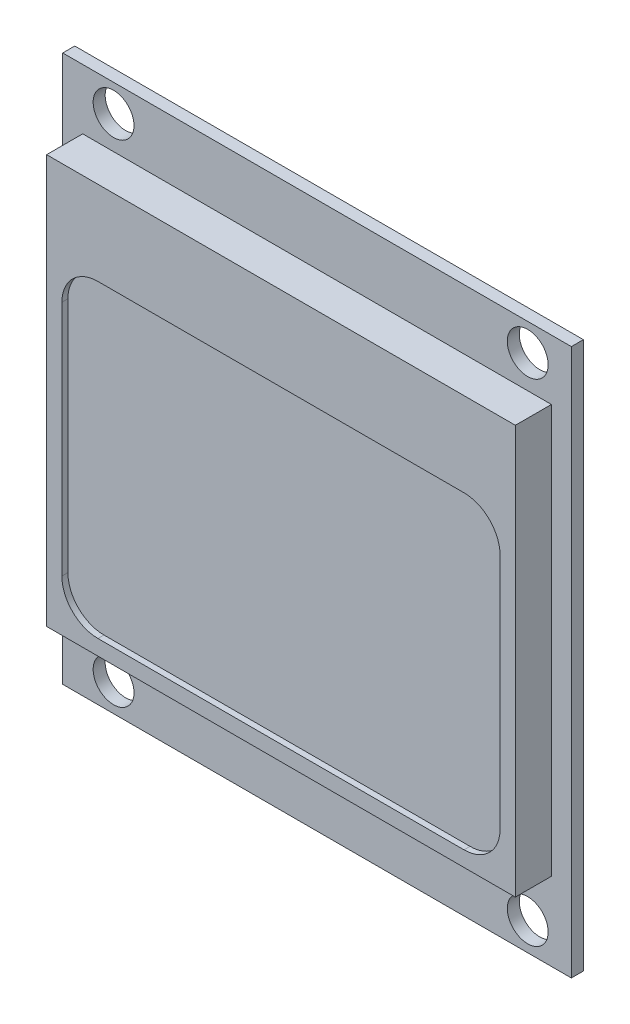
ISO-10303-21;
HEADER;
FILE_DESCRIPTION(('STEP AP214'),'2;1');
FILE_NAME('part.step','',(''),(''),'','','');
FILE_SCHEMA(('AUTOMOTIVE_DESIGN { 1 0 10303 214 1 1 1 1 }'));
ENDSEC;
DATA;
#1=APPLICATION_CONTEXT('core data for automotive mechanical design processes');
#2=APPLICATION_PROTOCOL_DEFINITION('international standard','automotive_design',2000,#1);
#3=PRODUCT_CONTEXT('',#1,'mechanical');
#4=PRODUCT('Part','Part','',(#3));
#5=PRODUCT_RELATED_PRODUCT_CATEGORY('part','',(#4));
#6=PRODUCT_DEFINITION_FORMATION('','',#4);
#7=PRODUCT_DEFINITION_CONTEXT('part definition',#1,'design');
#8=PRODUCT_DEFINITION('design','',#6,#7);
#9=PRODUCT_DEFINITION_SHAPE('','',#8);
#10=(LENGTH_UNIT() NAMED_UNIT(*) SI_UNIT(.MILLI.,.METRE.));
#11=(NAMED_UNIT(*) PLANE_ANGLE_UNIT() SI_UNIT($,.RADIAN.));
#12=(NAMED_UNIT(*) SI_UNIT($,.STERADIAN.) SOLID_ANGLE_UNIT());
#13=UNCERTAINTY_MEASURE_WITH_UNIT(LENGTH_MEASURE(1.E-05),#10,'distance_accuracy_value','');
#14=(GEOMETRIC_REPRESENTATION_CONTEXT(3) GLOBAL_UNCERTAINTY_ASSIGNED_CONTEXT((#13)) GLOBAL_UNIT_ASSIGNED_CONTEXT((#10,
#11,#12)) REPRESENTATION_CONTEXT('',''));
#15=CARTESIAN_POINT('',(0.,0.,0.));
#16=DIRECTION('',(0.,0.,1.));
#17=DIRECTION('',(1.,0.,0.));
#18=AXIS2_PLACEMENT_3D('',#15,#16,#17);
#19=CARTESIAN_POINT('',(0.,0.,12.));
#20=DIRECTION('',(0.,0.,-1.));
#21=DIRECTION('',(-1.,0.,0.));
#22=AXIS2_PLACEMENT_3D('',#19,#20,#21);
#23=PLANE('',#22);
#24=CARTESIAN_POINT('',(51.946913893828,63.235712471425,12.));
#25=DIRECTION('',(0.,0.,1.));
#26=DIRECTION('',(1.,0.,0.));
#27=AXIS2_PLACEMENT_3D('',#24,#25,#26);
#28=CIRCLE('',#27,1.7);
#29=CARTESIAN_POINT('',(53.646913893828,63.235712471425,12.));
#30=VERTEX_POINT('',#29);
#31=EDGE_CURVE('E273',#30,#30,#28,.T.);
#32=ORIENTED_EDGE('',*,*,#31,.F.);
#33=EDGE_LOOP('',(#32));
#34=FACE_BOUND('',#33,.T.);
#35=CARTESIAN_POINT('',(17.486918973838,63.235712471425,12.));
#36=DIRECTION('',(0.,0.,1.));
#37=DIRECTION('',(1.,0.,0.));
#38=AXIS2_PLACEMENT_3D('',#35,#36,#37);
#39=CIRCLE('',#38,1.7);
#40=CARTESIAN_POINT('',(19.186918973838,63.235712471425,12.));
#41=VERTEX_POINT('',#40);
#42=EDGE_CURVE('E279',#41,#41,#39,.T.);
#43=ORIENTED_EDGE('',*,*,#42,.F.);
#44=EDGE_LOOP('',(#43));
#45=FACE_BOUND('',#44,.T.);
#46=CARTESIAN_POINT('',(17.486918973838,22.360680721361,12.));
#47=DIRECTION('',(0.,0.,1.));
#48=DIRECTION('',(1.,0.,0.));
#49=AXIS2_PLACEMENT_3D('',#46,#47,#48);
#50=CIRCLE('',#49,1.7);
#51=CARTESIAN_POINT('',(19.186918973838,22.360680721361,12.));
#52=VERTEX_POINT('',#51);
#53=EDGE_CURVE('E285',#52,#52,#50,.T.);
#54=ORIENTED_EDGE('',*,*,#53,.F.);
#55=EDGE_LOOP('',(#54));
#56=FACE_BOUND('',#55,.T.);
#57=CARTESIAN_POINT('',(51.946913893828,22.360680721361,12.));
#58=DIRECTION('',(0.,0.,1.));
#59=DIRECTION('',(1.,0.,0.));
#60=AXIS2_PLACEMENT_3D('',#57,#58,#59);
#61=CIRCLE('',#60,1.7);
#62=CARTESIAN_POINT('',(53.646913893828,22.360680721361,12.));
#63=VERTEX_POINT('',#62);
#64=EDGE_CURVE('E291',#63,#63,#61,.T.);
#65=ORIENTED_EDGE('',*,*,#64,.F.);
#66=EDGE_LOOP('',(#65));
#67=FACE_BOUND('',#66,.T.);
#68=DIRECTION('',(0.,-1.,0.));
#69=VECTOR('',#68,1.);
#70=CARTESIAN_POINT('',(13.25698501397,20.0127000254,12.));
#71=LINE('',#70,#69);
#72=CARTESIAN_POINT('',(13.25698501397,65.5127000254,12.));
#73=VERTEX_POINT('',#72);
#74=CARTESIAN_POINT('',(13.25698501397,20.0127000254,12.));
#75=VERTEX_POINT('',#74);
#76=EDGE_CURVE('E297',#73,#75,#71,.T.);
#77=ORIENTED_EDGE('',*,*,#76,.T.);
#78=DIRECTION('',(1.,0.,0.));
#79=VECTOR('',#78,1.);
#80=CARTESIAN_POINT('',(13.25698501397,20.0127000254,12.));
#81=LINE('',#80,#79);
#82=CARTESIAN_POINT('',(55.57698501397,20.0127000254,12.));
#83=VERTEX_POINT('',#82);
#84=EDGE_CURVE('E300',#75,#83,#81,.T.);
#85=ORIENTED_EDGE('',*,*,#84,.T.);
#86=DIRECTION('',(0.,1.,0.));
#87=VECTOR('',#86,1.);
#88=CARTESIAN_POINT('',(55.57698501397,20.0127000254,12.));
#89=LINE('',#88,#87);
#90=CARTESIAN_POINT('',(55.57698501397,65.5127000254,12.));
#91=VERTEX_POINT('',#90);
#92=EDGE_CURVE('E303',#83,#91,#89,.T.);
#93=ORIENTED_EDGE('',*,*,#92,.T.);
#94=DIRECTION('',(-1.,0.,0.));
#95=VECTOR('',#94,1.);
#96=CARTESIAN_POINT('',(13.25698501397,65.5127000254,12.));
#97=LINE('',#96,#95);
#98=EDGE_CURVE('E305',#91,#73,#97,.T.);
#99=ORIENTED_EDGE('',*,*,#98,.T.);
#100=EDGE_LOOP('',(#77,#85,#93,#99));
#101=FACE_BOUND('',#100,.T.);
#102=DIRECTION('',(0.,-1.,0.));
#103=VECTOR('',#102,1.);
#104=CARTESIAN_POINT('',(14.91698501397,60.5127000254,12.));
#105=LINE('',#104,#103);
#106=CARTESIAN_POINT('',(14.91698501397,60.5127000254,12.));
#107=VERTEX_POINT('',#106);
#108=CARTESIAN_POINT('',(14.91698501397,26.5127000254,12.));
#109=VERTEX_POINT('',#108);
#110=EDGE_CURVE('E58',#107,#109,#105,.T.);
#111=ORIENTED_EDGE('',*,*,#110,.F.);
#112=DIRECTION('',(-1.,0.,0.));
#113=VECTOR('',#112,1.);
#114=CARTESIAN_POINT('',(14.91698501397,60.5127000254,12.));
#115=LINE('',#114,#113);
#116=CARTESIAN_POINT('',(53.91698501397,60.5127000254,12.));
#117=VERTEX_POINT('',#116);
#118=EDGE_CURVE('E246',#117,#107,#115,.T.);
#119=ORIENTED_EDGE('',*,*,#118,.F.);
#120=DIRECTION('',(0.,1.,0.));
#121=VECTOR('',#120,1.);
#122=CARTESIAN_POINT('',(53.91698501397,60.5127000254,12.));
#123=LINE('',#122,#121);
#124=CARTESIAN_POINT('',(53.91698501397,26.5127000254,12.));
#125=VERTEX_POINT('',#124);
#126=EDGE_CURVE('E257',#125,#117,#123,.T.);
#127=ORIENTED_EDGE('',*,*,#126,.F.);
#128=DIRECTION('',(1.,0.,0.));
#129=VECTOR('',#128,1.);
#130=CARTESIAN_POINT('',(14.91698501397,26.5127000254,12.));
#131=LINE('',#130,#129);
#132=EDGE_CURVE('E254',#109,#125,#131,.T.);
#133=ORIENTED_EDGE('',*,*,#132,.F.);
#134=EDGE_LOOP('',(#111,#119,#127,#133));
#135=FACE_BOUND('',#134,.T.);
#136=ADVANCED_FACE('F35',(#34,#45,#56,#67,#101,#135),#23,.F.);
#137=CARTESIAN_POINT('',(24.25698501397,22.095786131572,11.));
#138=DIRECTION('',(1.,0.,0.));
#139=DIRECTION('',(0.,0.,-1.));
#140=AXIS2_PLACEMENT_3D('',#137,#138,#139);
#141=PLANE('',#140);
#142=DIRECTION('',(0.,-1.,0.));
#143=VECTOR('',#142,1.);
#144=CARTESIAN_POINT('',(24.25698501397,22.095786131572,0.));
#145=LINE('',#144,#143);
#146=CARTESIAN_POINT('',(24.25698501397,24.635786131572,0.));
#147=VERTEX_POINT('',#146);
#148=CARTESIAN_POINT('',(24.25698501397,22.095786131572,0.));
#149=VERTEX_POINT('',#148);
#150=EDGE_CURVE('E326',#147,#149,#145,.T.);
#151=ORIENTED_EDGE('',*,*,#150,.T.);
#152=DIRECTION('',(0.,0.,-1.));
#153=VECTOR('',#152,1.);
#154=CARTESIAN_POINT('',(24.25698501397,22.095786131572,11.));
#155=LINE('',#154,#153);
#156=CARTESIAN_POINT('',(24.25698501397,22.095786131572,11.));
#157=VERTEX_POINT('',#156);
#158=EDGE_CURVE('E11',#157,#149,#155,.T.);
#159=ORIENTED_EDGE('',*,*,#158,.F.);
#160=DIRECTION('',(0.,-1.,0.));
#161=VECTOR('',#160,1.);
#162=CARTESIAN_POINT('',(24.25698501397,22.095786131572,11.));
#163=LINE('',#162,#161);
#164=CARTESIAN_POINT('',(24.25698501397,24.635786131572,11.));
#165=VERTEX_POINT('',#164);
#166=EDGE_CURVE('E327',#165,#157,#163,.T.);
#167=ORIENTED_EDGE('',*,*,#166,.F.);
#168=DIRECTION('',(0.,0.,-1.));
#169=VECTOR('',#168,1.);
#170=CARTESIAN_POINT('',(24.25698501397,24.635786131572,11.));
#171=LINE('',#170,#169);
#172=EDGE_CURVE('E340',#165,#147,#171,.T.);
#173=ORIENTED_EDGE('',*,*,#172,.T.);
#174=EDGE_LOOP('',(#151,#159,#167,#173));
#175=FACE_BOUND('',#174,.T.);
#176=ADVANCED_FACE('F37',(#175),#141,.F.);
#177=CARTESIAN_POINT('',(24.25698501397,22.095786131572,11.));
#178=DIRECTION('',(0.,1.,0.));
#179=DIRECTION('',(0.,0.,1.));
#180=AXIS2_PLACEMENT_3D('',#177,#178,#179);
#181=PLANE('',#180);
#182=DIRECTION('',(1.,0.,0.));
#183=VECTOR('',#182,1.);
#184=CARTESIAN_POINT('',(24.25698501397,22.095786131572,0.));
#185=LINE('',#184,#183);
#186=CARTESIAN_POINT('',(44.57698501397,22.095786131572,0.));
#187=VERTEX_POINT('',#186);
#188=EDGE_CURVE('E343',#149,#187,#185,.T.);
#189=ORIENTED_EDGE('',*,*,#188,.T.);
#190=DIRECTION('',(0.,0.,-1.));
#191=VECTOR('',#190,1.);
#192=CARTESIAN_POINT('',(44.57698501397,22.095786131572,11.));
#193=LINE('',#192,#191);
#194=CARTESIAN_POINT('',(44.57698501397,22.095786131572,11.));
#195=VERTEX_POINT('',#194);
#196=EDGE_CURVE('E43',#195,#187,#193,.T.);
#197=ORIENTED_EDGE('',*,*,#196,.F.);
#198=DIRECTION('',(1.,0.,0.));
#199=VECTOR('',#198,1.);
#200=CARTESIAN_POINT('',(24.25698501397,22.095786131572,11.));
#201=LINE('',#200,#199);
#202=EDGE_CURVE('E330',#157,#195,#201,.T.);
#203=ORIENTED_EDGE('',*,*,#202,.F.);
#204=ORIENTED_EDGE('',*,*,#158,.T.);
#205=EDGE_LOOP('',(#189,#197,#203,#204));
#206=FACE_BOUND('',#205,.T.);
#207=ADVANCED_FACE('F371',(#206),#181,.F.);
#208=CARTESIAN_POINT('',(44.57698501397,22.095786131572,11.));
#209=DIRECTION('',(-1.,0.,0.));
#210=DIRECTION('',(0.,-1.,0.));
#211=AXIS2_PLACEMENT_3D('',#208,#209,#210);
#212=PLANE('',#211);
#213=DIRECTION('',(0.,1.,0.));
#214=VECTOR('',#213,1.);
#215=CARTESIAN_POINT('',(44.57698501397,22.095786131572,0.));
#216=LINE('',#215,#214);
#217=CARTESIAN_POINT('',(44.57698501397,24.635786131572,0.));
#218=VERTEX_POINT('',#217);
#219=EDGE_CURVE('E345',#187,#218,#216,.T.);
#220=ORIENTED_EDGE('',*,*,#219,.T.);
#221=DIRECTION('',(0.,0.,-1.));
#222=VECTOR('',#221,1.);
#223=CARTESIAN_POINT('',(44.57698501397,24.635786131572,11.));
#224=LINE('',#223,#222);
#225=CARTESIAN_POINT('',(44.57698501397,24.635786131572,11.));
#226=VERTEX_POINT('',#225);
#227=EDGE_CURVE('E350',#226,#218,#224,.T.);
#228=ORIENTED_EDGE('',*,*,#227,.F.);
#229=DIRECTION('',(0.,1.,0.));
#230=VECTOR('',#229,1.);
#231=CARTESIAN_POINT('',(44.57698501397,22.095786131572,11.));
#232=LINE('',#231,#230);
#233=EDGE_CURVE('E334',#195,#226,#232,.T.);
#234=ORIENTED_EDGE('',*,*,#233,.F.);
#235=ORIENTED_EDGE('',*,*,#196,.T.);
#236=EDGE_LOOP('',(#220,#228,#234,#235));
#237=FACE_BOUND('',#236,.T.);
#238=ADVANCED_FACE('F356',(#237),#212,.F.);
#239=CARTESIAN_POINT('',(24.25698501397,24.635786131572,11.));
#240=DIRECTION('',(0.,-1.,0.));
#241=DIRECTION('',(0.,0.,-1.));
#242=AXIS2_PLACEMENT_3D('',#239,#240,#241);
#243=PLANE('',#242);
#244=DIRECTION('',(-1.,0.,0.));
#245=VECTOR('',#244,1.);
#246=CARTESIAN_POINT('',(24.25698501397,24.635786131572,0.));
#247=LINE('',#246,#245);
#248=EDGE_CURVE('E331',#218,#147,#247,.T.);
#249=ORIENTED_EDGE('',*,*,#248,.T.);
#250=ORIENTED_EDGE('',*,*,#172,.F.);
#251=DIRECTION('',(-1.,0.,0.));
#252=VECTOR('',#251,1.);
#253=CARTESIAN_POINT('',(24.25698501397,24.635786131572,11.));
#254=LINE('',#253,#252);
#255=EDGE_CURVE('E337',#226,#165,#254,.T.);
#256=ORIENTED_EDGE('',*,*,#255,.F.);
#257=ORIENTED_EDGE('',*,*,#227,.T.);
#258=EDGE_LOOP('',(#249,#250,#256,#257));
#259=FACE_BOUND('',#258,.T.);
#260=ADVANCED_FACE('F364',(#259),#243,.F.);
#261=CARTESIAN_POINT('',(0.,0.,0.));
#262=DIRECTION('',(0.,0.,-1.));
#263=DIRECTION('',(-1.,0.,0.));
#264=AXIS2_PLACEMENT_3D('',#261,#262,#263);
#265=PLANE('',#264);
#266=ORIENTED_EDGE('',*,*,#150,.F.);
#267=ORIENTED_EDGE('',*,*,#248,.F.);
#268=ORIENTED_EDGE('',*,*,#219,.F.);
#269=ORIENTED_EDGE('',*,*,#188,.F.);
#270=EDGE_LOOP('',(#266,#267,#268,#269));
#271=FACE_BOUND('',#270,.T.);
#272=ADVANCED_FACE('F361',(#271),#265,.T.);
#273=CARTESIAN_POINT('',(0.,0.,11.));
#274=DIRECTION('',(0.,0.,-1.));
#275=DIRECTION('',(-1.,0.,0.));
#276=AXIS2_PLACEMENT_3D('',#273,#274,#275);
#277=PLANE('',#276);
#278=ORIENTED_EDGE('',*,*,#255,.T.);
#279=ORIENTED_EDGE('',*,*,#166,.T.);
#280=ORIENTED_EDGE('',*,*,#202,.T.);
#281=ORIENTED_EDGE('',*,*,#233,.T.);
#282=EDGE_LOOP('',(#278,#279,#280,#281));
#283=FACE_BOUND('',#282,.T.);
#284=CARTESIAN_POINT('',(17.486918973838,63.235712471425,11.));
#285=DIRECTION('',(0.,0.,1.));
#286=DIRECTION('',(1.,0.,0.));
#287=AXIS2_PLACEMENT_3D('',#284,#285,#286);
#288=CIRCLE('',#287,1.7);
#289=CARTESIAN_POINT('',(19.186918973838,63.235712471425,11.));
#290=VERTEX_POINT('',#289);
#291=EDGE_CURVE('E276',#290,#290,#288,.T.);
#292=ORIENTED_EDGE('',*,*,#291,.T.);
#293=EDGE_LOOP('',(#292));
#294=FACE_BOUND('',#293,.T.);
#295=CARTESIAN_POINT('',(51.946913893828,22.360680721361,11.));
#296=DIRECTION('',(0.,0.,1.));
#297=DIRECTION('',(1.,0.,0.));
#298=AXIS2_PLACEMENT_3D('',#295,#296,#297);
#299=CIRCLE('',#298,1.7);
#300=CARTESIAN_POINT('',(53.646913893828,22.360680721361,11.));
#301=VERTEX_POINT('',#300);
#302=EDGE_CURVE('E288',#301,#301,#299,.T.);
#303=ORIENTED_EDGE('',*,*,#302,.T.);
#304=EDGE_LOOP('',(#303));
#305=FACE_BOUND('',#304,.T.);
#306=DIRECTION('',(0.,-1.,0.));
#307=VECTOR('',#306,1.);
#308=CARTESIAN_POINT('',(13.25698501397,20.0127000254,11.));
#309=LINE('',#308,#307);
#310=CARTESIAN_POINT('',(13.25698501397,65.5127000254,11.));
#311=VERTEX_POINT('',#310);
#312=CARTESIAN_POINT('',(13.25698501397,20.0127000254,11.));
#313=VERTEX_POINT('',#312);
#314=EDGE_CURVE('E294',#311,#313,#309,.T.);
#315=ORIENTED_EDGE('',*,*,#314,.F.);
#316=DIRECTION('',(-1.,0.,0.));
#317=VECTOR('',#316,1.);
#318=CARTESIAN_POINT('',(13.25698501397,65.5127000254,11.));
#319=LINE('',#318,#317);
#320=CARTESIAN_POINT('',(55.57698501397,65.5127000254,11.));
#321=VERTEX_POINT('',#320);
#322=EDGE_CURVE('E301',#321,#311,#319,.T.);
#323=ORIENTED_EDGE('',*,*,#322,.F.);
#324=DIRECTION('',(0.,1.,0.));
#325=VECTOR('',#324,1.);
#326=CARTESIAN_POINT('',(55.57698501397,20.0127000254,11.));
#327=LINE('',#326,#325);
#328=CARTESIAN_POINT('',(55.57698501397,20.0127000254,11.));
#329=VERTEX_POINT('',#328);
#330=EDGE_CURVE('E312',#329,#321,#327,.T.);
#331=ORIENTED_EDGE('',*,*,#330,.F.);
#332=DIRECTION('',(1.,0.,0.));
#333=VECTOR('',#332,1.);
#334=CARTESIAN_POINT('',(13.25698501397,20.0127000254,11.));
#335=LINE('',#334,#333);
#336=EDGE_CURVE('E310',#313,#329,#335,.T.);
#337=ORIENTED_EDGE('',*,*,#336,.F.);
#338=EDGE_LOOP('',(#315,#323,#331,#337));
#339=FACE_BOUND('',#338,.T.);
#340=CARTESIAN_POINT('',(17.486918973838,22.360680721361,11.));
#341=DIRECTION('',(0.,0.,1.));
#342=DIRECTION('',(1.,0.,0.));
#343=AXIS2_PLACEMENT_3D('',#340,#341,#342);
#344=CIRCLE('',#343,1.7);
#345=CARTESIAN_POINT('',(19.186918973838,22.360680721361,11.));
#346=VERTEX_POINT('',#345);
#347=EDGE_CURVE('E282',#346,#346,#344,.T.);
#348=ORIENTED_EDGE('',*,*,#347,.T.);
#349=EDGE_LOOP('',(#348));
#350=FACE_BOUND('',#349,.T.);
#351=CARTESIAN_POINT('',(51.946913893828,63.235712471425,11.));
#352=DIRECTION('',(0.,0.,1.));
#353=DIRECTION('',(1.,0.,0.));
#354=AXIS2_PLACEMENT_3D('',#351,#352,#353);
#355=CIRCLE('',#354,1.7);
#356=CARTESIAN_POINT('',(53.646913893828,63.235712471425,11.));
#357=VERTEX_POINT('',#356);
#358=EDGE_CURVE('E272',#357,#357,#355,.T.);
#359=ORIENTED_EDGE('',*,*,#358,.T.);
#360=EDGE_LOOP('',(#359));
#361=FACE_BOUND('',#360,.T.);
#362=ADVANCED_FACE('F369',(#283,#294,#305,#339,#350,#361),#277,.T.);
#363=CARTESIAN_POINT('',(13.25698501397,20.0127000254,12.));
#364=DIRECTION('',(1.,0.,0.));
#365=DIRECTION('',(0.,0.,-1.));
#366=AXIS2_PLACEMENT_3D('',#363,#364,#365);
#367=PLANE('',#366);
#368=ORIENTED_EDGE('',*,*,#314,.T.);
#369=DIRECTION('',(0.,0.,-1.));
#370=VECTOR('',#369,1.);
#371=CARTESIAN_POINT('',(13.25698501397,20.0127000254,12.));
#372=LINE('',#371,#370);
#373=EDGE_CURVE('E323',#75,#313,#372,.T.);
#374=ORIENTED_EDGE('',*,*,#373,.F.);
#375=ORIENTED_EDGE('',*,*,#76,.F.);
#376=DIRECTION('',(0.,0.,-1.));
#377=VECTOR('',#376,1.);
#378=CARTESIAN_POINT('',(13.25698501397,65.5127000254,12.));
#379=LINE('',#378,#377);
#380=EDGE_CURVE('E307',#73,#311,#379,.T.);
#381=ORIENTED_EDGE('',*,*,#380,.T.);
#382=EDGE_LOOP('',(#368,#374,#375,#381));
#383=FACE_BOUND('',#382,.T.);
#384=ADVANCED_FACE('F391',(#383),#367,.F.);
#385=CARTESIAN_POINT('',(13.25698501397,20.0127000254,12.));
#386=DIRECTION('',(0.,1.,0.));
#387=DIRECTION('',(0.,0.,1.));
#388=AXIS2_PLACEMENT_3D('',#385,#386,#387);
#389=PLANE('',#388);
#390=ORIENTED_EDGE('',*,*,#336,.T.);
#391=DIRECTION('',(0.,0.,-1.));
#392=VECTOR('',#391,1.);
#393=CARTESIAN_POINT('',(55.57698501397,20.0127000254,12.));
#394=LINE('',#393,#392);
#395=EDGE_CURVE('E320',#83,#329,#394,.T.);
#396=ORIENTED_EDGE('',*,*,#395,.F.);
#397=ORIENTED_EDGE('',*,*,#84,.F.);
#398=ORIENTED_EDGE('',*,*,#373,.T.);
#399=EDGE_LOOP('',(#390,#396,#397,#398));
#400=FACE_BOUND('',#399,.T.);
#401=ADVANCED_FACE('F399',(#400),#389,.F.);
#402=CARTESIAN_POINT('',(55.57698501397,20.0127000254,12.));
#403=DIRECTION('',(-1.,0.,0.));
#404=DIRECTION('',(0.,0.,1.));
#405=AXIS2_PLACEMENT_3D('',#402,#403,#404);
#406=PLANE('',#405);
#407=ORIENTED_EDGE('',*,*,#330,.T.);
#408=DIRECTION('',(0.,0.,-1.));
#409=VECTOR('',#408,1.);
#410=CARTESIAN_POINT('',(55.57698501397,65.5127000254,12.));
#411=LINE('',#410,#409);
#412=EDGE_CURVE('E317',#91,#321,#411,.T.);
#413=ORIENTED_EDGE('',*,*,#412,.F.);
#414=ORIENTED_EDGE('',*,*,#92,.F.);
#415=ORIENTED_EDGE('',*,*,#395,.T.);
#416=EDGE_LOOP('',(#407,#413,#414,#415));
#417=FACE_BOUND('',#416,.T.);
#418=ADVANCED_FACE('F395',(#417),#406,.F.);
#419=CARTESIAN_POINT('',(13.25698501397,65.5127000254,12.));
#420=DIRECTION('',(0.,-1.,0.));
#421=DIRECTION('',(0.,0.,-1.));
#422=AXIS2_PLACEMENT_3D('',#419,#420,#421);
#423=PLANE('',#422);
#424=ORIENTED_EDGE('',*,*,#322,.T.);
#425=ORIENTED_EDGE('',*,*,#380,.F.);
#426=ORIENTED_EDGE('',*,*,#98,.F.);
#427=ORIENTED_EDGE('',*,*,#412,.T.);
#428=EDGE_LOOP('',(#424,#425,#426,#427));
#429=FACE_BOUND('',#428,.T.);
#430=ADVANCED_FACE('F392',(#429),#423,.F.);
#431=CARTESIAN_POINT('',(51.946913893828,22.360680721361,12.));
#432=DIRECTION('',(0.,0.,-1.));
#433=DIRECTION('',(-1.,0.,0.));
#434=AXIS2_PLACEMENT_3D('',#431,#432,#433);
#435=CYLINDRICAL_SURFACE('',#434,1.7);
#436=ORIENTED_EDGE('',*,*,#64,.T.);
#437=EDGE_LOOP('',(#436));
#438=FACE_BOUND('',#437,.T.);
#439=ORIENTED_EDGE('',*,*,#302,.F.);
#440=EDGE_LOOP('',(#439));
#441=FACE_BOUND('',#440,.T.);
#442=ADVANCED_FACE('F387',(#438,#441),#435,.F.);
#443=CARTESIAN_POINT('',(17.486918973838,22.360680721361,12.));
#444=DIRECTION('',(0.,0.,-1.));
#445=DIRECTION('',(-1.,0.,0.));
#446=AXIS2_PLACEMENT_3D('',#443,#444,#445);
#447=CYLINDRICAL_SURFACE('',#446,1.7);
#448=ORIENTED_EDGE('',*,*,#53,.T.);
#449=EDGE_LOOP('',(#448));
#450=FACE_BOUND('',#449,.T.);
#451=ORIENTED_EDGE('',*,*,#347,.F.);
#452=EDGE_LOOP('',(#451));
#453=FACE_BOUND('',#452,.T.);
#454=ADVANCED_FACE('F445',(#450,#453),#447,.F.);
#455=CARTESIAN_POINT('',(17.486918973838,63.235712471425,12.));
#456=DIRECTION('',(0.,0.,-1.));
#457=DIRECTION('',(-1.,0.,0.));
#458=AXIS2_PLACEMENT_3D('',#455,#456,#457);
#459=CYLINDRICAL_SURFACE('',#458,1.7);
#460=ORIENTED_EDGE('',*,*,#42,.T.);
#461=EDGE_LOOP('',(#460));
#462=FACE_BOUND('',#461,.T.);
#463=ORIENTED_EDGE('',*,*,#291,.F.);
#464=EDGE_LOOP('',(#463));
#465=FACE_BOUND('',#464,.T.);
#466=ADVANCED_FACE('F452',(#462,#465),#459,.F.);
#467=CARTESIAN_POINT('',(51.946913893828,63.235712471425,12.));
#468=DIRECTION('',(0.,0.,-1.));
#469=DIRECTION('',(-1.,0.,0.));
#470=AXIS2_PLACEMENT_3D('',#467,#468,#469);
#471=CYLINDRICAL_SURFACE('',#470,1.7);
#472=ORIENTED_EDGE('',*,*,#31,.T.);
#473=EDGE_LOOP('',(#472));
#474=FACE_BOUND('',#473,.T.);
#475=ORIENTED_EDGE('',*,*,#358,.F.);
#476=EDGE_LOOP('',(#475));
#477=FACE_BOUND('',#476,.T.);
#478=ADVANCED_FACE('F459',(#474,#477),#471,.F.);
#479=CARTESIAN_POINT('',(14.91698501397,60.5127000254,15.));
#480=DIRECTION('',(1.,0.,0.));
#481=DIRECTION('',(0.,1.,0.));
#482=AXIS2_PLACEMENT_3D('',#479,#480,#481);
#483=PLANE('',#482);
#484=ORIENTED_EDGE('',*,*,#110,.T.);
#485=DIRECTION('',(0.,0.,-1.));
#486=VECTOR('',#485,1.);
#487=CARTESIAN_POINT('',(14.91698501397,26.5127000254,15.));
#488=LINE('',#487,#486);
#489=CARTESIAN_POINT('',(14.91698501397,26.5127000254,15.));
#490=VERTEX_POINT('',#489);
#491=EDGE_CURVE('E269',#490,#109,#488,.T.);
#492=ORIENTED_EDGE('',*,*,#491,.F.);
#493=DIRECTION('',(0.,-1.,0.));
#494=VECTOR('',#493,1.);
#495=CARTESIAN_POINT('',(14.91698501397,60.5127000254,15.));
#496=LINE('',#495,#494);
#497=CARTESIAN_POINT('',(14.91698501397,60.5127000254,15.));
#498=VERTEX_POINT('',#497);
#499=EDGE_CURVE('E242',#498,#490,#496,.T.);
#500=ORIENTED_EDGE('',*,*,#499,.F.);
#501=DIRECTION('',(0.,0.,-1.));
#502=VECTOR('',#501,1.);
#503=CARTESIAN_POINT('',(14.91698501397,60.5127000254,15.));
#504=LINE('',#503,#502);
#505=EDGE_CURVE('E252',#498,#107,#504,.T.);
#506=ORIENTED_EDGE('',*,*,#505,.T.);
#507=EDGE_LOOP('',(#484,#492,#500,#506));
#508=FACE_BOUND('',#507,.T.);
#509=ADVANCED_FACE('F467',(#508),#483,.F.);
#510=CARTESIAN_POINT('',(14.91698501397,26.5127000254,15.));
#511=DIRECTION('',(0.,1.,0.));
#512=DIRECTION('',(0.,0.,1.));
#513=AXIS2_PLACEMENT_3D('',#510,#511,#512);
#514=PLANE('',#513);
#515=ORIENTED_EDGE('',*,*,#132,.T.);
#516=DIRECTION('',(0.,0.,-1.));
#517=VECTOR('',#516,1.);
#518=CARTESIAN_POINT('',(53.91698501397,26.5127000254,15.));
#519=LINE('',#518,#517);
#520=CARTESIAN_POINT('',(53.91698501397,26.5127000254,15.));
#521=VERTEX_POINT('',#520);
#522=EDGE_CURVE('E266',#521,#125,#519,.T.);
#523=ORIENTED_EDGE('',*,*,#522,.F.);
#524=DIRECTION('',(1.,0.,0.));
#525=VECTOR('',#524,1.);
#526=CARTESIAN_POINT('',(14.91698501397,26.5127000254,15.));
#527=LINE('',#526,#525);
#528=EDGE_CURVE('E245',#490,#521,#527,.T.);
#529=ORIENTED_EDGE('',*,*,#528,.F.);
#530=ORIENTED_EDGE('',*,*,#491,.T.);
#531=EDGE_LOOP('',(#515,#523,#529,#530));
#532=FACE_BOUND('',#531,.T.);
#533=ADVANCED_FACE('F475',(#532),#514,.F.);
#534=CARTESIAN_POINT('',(53.91698501397,60.5127000254,15.));
#535=DIRECTION('',(-1.,0.,0.));
#536=DIRECTION('',(0.,-1.,0.));
#537=AXIS2_PLACEMENT_3D('',#534,#535,#536);
#538=PLANE('',#537);
#539=ORIENTED_EDGE('',*,*,#126,.T.);
#540=DIRECTION('',(0.,0.,-1.));
#541=VECTOR('',#540,1.);
#542=CARTESIAN_POINT('',(53.91698501397,60.5127000254,15.));
#543=LINE('',#542,#541);
#544=CARTESIAN_POINT('',(53.91698501397,60.5127000254,15.));
#545=VERTEX_POINT('',#544);
#546=EDGE_CURVE('E263',#545,#117,#543,.T.);
#547=ORIENTED_EDGE('',*,*,#546,.F.);
#548=DIRECTION('',(0.,1.,0.));
#549=VECTOR('',#548,1.);
#550=CARTESIAN_POINT('',(53.91698501397,60.5127000254,15.));
#551=LINE('',#550,#549);
#552=EDGE_CURVE('E248',#521,#545,#551,.T.);
#553=ORIENTED_EDGE('',*,*,#552,.F.);
#554=ORIENTED_EDGE('',*,*,#522,.T.);
#555=EDGE_LOOP('',(#539,#547,#553,#554));
#556=FACE_BOUND('',#555,.T.);
#557=ADVANCED_FACE('F483',(#556),#538,.F.);
#558=CARTESIAN_POINT('',(14.91698501397,60.5127000254,15.));
#559=DIRECTION('',(0.,-1.,0.));
#560=DIRECTION('',(0.,0.,-1.));
#561=AXIS2_PLACEMENT_3D('',#558,#559,#560);
#562=PLANE('',#561);
#563=ORIENTED_EDGE('',*,*,#118,.T.);
#564=ORIENTED_EDGE('',*,*,#505,.F.);
#565=DIRECTION('',(-1.,0.,0.));
#566=VECTOR('',#565,1.);
#567=CARTESIAN_POINT('',(14.91698501397,60.5127000254,15.));
#568=LINE('',#567,#566);
#569=EDGE_CURVE('E250',#545,#498,#568,.T.);
#570=ORIENTED_EDGE('',*,*,#569,.F.);
#571=ORIENTED_EDGE('',*,*,#546,.T.);
#572=EDGE_LOOP('',(#563,#564,#570,#571));
#573=FACE_BOUND('',#572,.T.);
#574=ADVANCED_FACE('F491',(#573),#562,.F.);
#575=CARTESIAN_POINT('',(0.,0.,15.));
#576=DIRECTION('',(0.,0.,1.));
#577=DIRECTION('',(1.,0.,0.));
#578=AXIS2_PLACEMENT_3D('',#575,#576,#577);
#579=PLANE('',#578);
#580=CARTESIAN_POINT('',(19.18698501397,30.7827000254,15.));
#581=DIRECTION('',(0.,0.,1.));
#582=DIRECTION('',(-1.,0.,0.));
#583=AXIS2_PLACEMENT_3D('',#580,#581,#582);
#584=CIRCLE('',#583,3.);
#585=CARTESIAN_POINT('',(16.18698501397,30.7827000254,15.));
#586=VERTEX_POINT('',#585);
#587=CARTESIAN_POINT('',(19.18698501397,27.7827000254,15.));
#588=VERTEX_POINT('',#587);
#589=EDGE_CURVE('E50',#586,#588,#584,.T.);
#590=ORIENTED_EDGE('',*,*,#589,.F.);
#591=DIRECTION('',(0.,-1.,0.));
#592=VECTOR('',#591,1.);
#593=CARTESIAN_POINT('',(16.18698501397,30.7827000254,15.));
#594=LINE('',#593,#592);
#595=CARTESIAN_POINT('',(16.18698501397,50.5127000254,15.));
#596=VERTEX_POINT('',#595);
#597=EDGE_CURVE('E193',#596,#586,#594,.T.);
#598=ORIENTED_EDGE('',*,*,#597,.F.);
#599=CARTESIAN_POINT('',(19.18698501397,50.5127000254,15.));
#600=DIRECTION('',(0.,0.,1.));
#601=DIRECTION('',(1.,0.,0.));
#602=AXIS2_PLACEMENT_3D('',#599,#600,#601);
#603=CIRCLE('',#602,3.);
#604=CARTESIAN_POINT('',(19.18698501397,53.5127000254,15.));
#605=VERTEX_POINT('',#604);
#606=EDGE_CURVE('E196',#605,#596,#603,.T.);
#607=ORIENTED_EDGE('',*,*,#606,.F.);
#608=DIRECTION('',(-1.,0.,0.));
#609=VECTOR('',#608,1.);
#610=CARTESIAN_POINT('',(49.64698501397,53.5127000254,15.));
#611=LINE('',#610,#609);
#612=CARTESIAN_POINT('',(49.64698501397,53.5127000254,15.));
#613=VERTEX_POINT('',#612);
#614=EDGE_CURVE('E224',#613,#605,#611,.T.);
#615=ORIENTED_EDGE('',*,*,#614,.F.);
#616=CARTESIAN_POINT('',(49.64698501397,50.5127000254,15.));
#617=DIRECTION('',(0.,0.,1.));
#618=DIRECTION('',(1.,0.,0.));
#619=AXIS2_PLACEMENT_3D('',#616,#617,#618);
#620=CIRCLE('',#619,3.);
#621=CARTESIAN_POINT('',(52.64698501397,50.5127000254,15.));
#622=VERTEX_POINT('',#621);
#623=EDGE_CURVE('E221',#622,#613,#620,.T.);
#624=ORIENTED_EDGE('',*,*,#623,.F.);
#625=DIRECTION('',(0.,1.,0.));
#626=VECTOR('',#625,1.);
#627=CARTESIAN_POINT('',(52.64698501397,30.7827000254,15.));
#628=LINE('',#627,#626);
#629=CARTESIAN_POINT('',(52.64698501397,30.7827000254,15.));
#630=VERTEX_POINT('',#629);
#631=EDGE_CURVE('E218',#630,#622,#628,.T.);
#632=ORIENTED_EDGE('',*,*,#631,.F.);
#633=CARTESIAN_POINT('',(49.64698501397,30.7827000254,15.));
#634=DIRECTION('',(0.,0.,1.));
#635=DIRECTION('',(1.,0.,0.));
#636=AXIS2_PLACEMENT_3D('',#633,#634,#635);
#637=CIRCLE('',#636,3.);
#638=CARTESIAN_POINT('',(49.64698501397,27.7827000254,15.));
#639=VERTEX_POINT('',#638);
#640=EDGE_CURVE('E215',#639,#630,#637,.T.);
#641=ORIENTED_EDGE('',*,*,#640,.F.);
#642=DIRECTION('',(1.,0.,0.));
#643=VECTOR('',#642,1.);
#644=CARTESIAN_POINT('',(49.64698501397,27.7827000254,15.));
#645=LINE('',#644,#643);
#646=EDGE_CURVE('E213',#588,#639,#645,.T.);
#647=ORIENTED_EDGE('',*,*,#646,.F.);
#648=EDGE_LOOP('',(#590,#598,#607,#615,#624,#632,#641,#647));
#649=FACE_BOUND('',#648,.T.);
#650=ORIENTED_EDGE('',*,*,#499,.T.);
#651=ORIENTED_EDGE('',*,*,#528,.T.);
#652=ORIENTED_EDGE('',*,*,#552,.T.);
#653=ORIENTED_EDGE('',*,*,#569,.T.);
#654=EDGE_LOOP('',(#650,#651,#652,#653));
#655=FACE_BOUND('',#654,.T.);
#656=ADVANCED_FACE('F499',(#649,#655),#579,.T.);
#657=CARTESIAN_POINT('',(19.18698501397,30.7827000254,14.5));
#658=DIRECTION('',(0.,0.,1.));
#659=DIRECTION('',(1.,0.,0.));
#660=AXIS2_PLACEMENT_3D('',#657,#658,#659);
#661=CYLINDRICAL_SURFACE('',#660,3.);
#662=ORIENTED_EDGE('',*,*,#589,.T.);
#663=DIRECTION('',(0.,0.,1.));
#664=VECTOR('',#663,1.);
#665=CARTESIAN_POINT('',(19.18698501397,27.7827000254,14.5));
#666=LINE('',#665,#664);
#667=CARTESIAN_POINT('',(19.18698501397,27.7827000254,14.5));
#668=VERTEX_POINT('',#667);
#669=EDGE_CURVE('E170',#668,#588,#666,.T.);
#670=ORIENTED_EDGE('',*,*,#669,.F.);
#671=CARTESIAN_POINT('',(19.18698501397,30.7827000254,14.5));
#672=DIRECTION('',(0.,0.,1.));
#673=DIRECTION('',(-1.,0.,0.));
#674=AXIS2_PLACEMENT_3D('',#671,#672,#673);
#675=CIRCLE('',#674,3.);
#676=CARTESIAN_POINT('',(16.18698501397,30.7827000254,14.5));
#677=VERTEX_POINT('',#676);
#678=EDGE_CURVE('E174',#677,#668,#675,.T.);
#679=ORIENTED_EDGE('',*,*,#678,.F.);
#680=DIRECTION('',(0.,0.,1.));
#681=VECTOR('',#680,1.);
#682=CARTESIAN_POINT('',(16.18698501397,30.7827000254,14.5));
#683=LINE('',#682,#681);
#684=EDGE_CURVE('E229',#677,#586,#683,.T.);
#685=ORIENTED_EDGE('',*,*,#684,.T.);
#686=EDGE_LOOP('',(#662,#670,#679,#685));
#687=FACE_BOUND('',#686,.T.);
#688=ADVANCED_FACE('F172',(#687),#661,.F.);
#689=CARTESIAN_POINT('',(16.18698501397,30.7827000254,14.5));
#690=DIRECTION('',(-1.,0.,0.));
#691=DIRECTION('',(0.,-1.,0.));
#692=AXIS2_PLACEMENT_3D('',#689,#690,#691);
#693=PLANE('',#692);
#694=ORIENTED_EDGE('',*,*,#597,.T.);
#695=ORIENTED_EDGE('',*,*,#684,.F.);
#696=DIRECTION('',(0.,-1.,0.));
#697=VECTOR('',#696,1.);
#698=CARTESIAN_POINT('',(16.18698501397,30.7827000254,14.5));
#699=LINE('',#698,#697);
#700=CARTESIAN_POINT('',(16.18698501397,50.5127000254,14.5));
#701=VERTEX_POINT('',#700);
#702=EDGE_CURVE('E180',#701,#677,#699,.T.);
#703=ORIENTED_EDGE('',*,*,#702,.F.);
#704=DIRECTION('',(0.,0.,1.));
#705=VECTOR('',#704,1.);
#706=CARTESIAN_POINT('',(16.18698501397,50.5127000254,14.5));
#707=LINE('',#706,#705);
#708=EDGE_CURVE('E231',#701,#596,#707,.T.);
#709=ORIENTED_EDGE('',*,*,#708,.T.);
#710=EDGE_LOOP('',(#694,#695,#703,#709));
#711=FACE_BOUND('',#710,.T.);
#712=ADVANCED_FACE('F514',(#711),#693,.F.);
#713=CARTESIAN_POINT('',(19.18698501397,50.5127000254,14.5));
#714=DIRECTION('',(0.,0.,1.));
#715=DIRECTION('',(1.,0.,0.));
#716=AXIS2_PLACEMENT_3D('',#713,#714,#715);
#717=CYLINDRICAL_SURFACE('',#716,3.);
#718=ORIENTED_EDGE('',*,*,#606,.T.);
#719=ORIENTED_EDGE('',*,*,#708,.F.);
#720=CARTESIAN_POINT('',(19.18698501397,50.5127000254,14.5));
#721=DIRECTION('',(0.,0.,1.));
#722=DIRECTION('',(1.,0.,0.));
#723=AXIS2_PLACEMENT_3D('',#720,#721,#722);
#724=CIRCLE('',#723,3.);
#725=CARTESIAN_POINT('',(19.18698501397,53.5127000254,14.5));
#726=VERTEX_POINT('',#725);
#727=EDGE_CURVE('E209',#726,#701,#724,.T.);
#728=ORIENTED_EDGE('',*,*,#727,.F.);
#729=DIRECTION('',(0.,0.,1.));
#730=VECTOR('',#729,1.);
#731=CARTESIAN_POINT('',(19.18698501397,53.5127000254,14.5));
#732=LINE('',#731,#730);
#733=EDGE_CURVE('E233',#726,#605,#732,.T.);
#734=ORIENTED_EDGE('',*,*,#733,.T.);
#735=EDGE_LOOP('',(#718,#719,#728,#734));
#736=FACE_BOUND('',#735,.T.);
#737=ADVANCED_FACE('F521',(#736),#717,.F.);
#738=CARTESIAN_POINT('',(49.64698501397,53.5127000254,14.5));
#739=DIRECTION('',(0.,1.,0.));
#740=DIRECTION('',(-1.,0.,0.));
#741=AXIS2_PLACEMENT_3D('',#738,#739,#740);
#742=PLANE('',#741);
#743=ORIENTED_EDGE('',*,*,#614,.T.);
#744=ORIENTED_EDGE('',*,*,#733,.F.);
#745=DIRECTION('',(-1.,0.,0.));
#746=VECTOR('',#745,1.);
#747=CARTESIAN_POINT('',(49.64698501397,53.5127000254,14.5));
#748=LINE('',#747,#746);
#749=CARTESIAN_POINT('',(49.64698501397,53.5127000254,14.5));
#750=VERTEX_POINT('',#749);
#751=EDGE_CURVE('E206',#750,#726,#748,.T.);
#752=ORIENTED_EDGE('',*,*,#751,.F.);
#753=DIRECTION('',(0.,0.,1.));
#754=VECTOR('',#753,1.);
#755=CARTESIAN_POINT('',(49.64698501397,53.5127000254,14.5));
#756=LINE('',#755,#754);
#757=EDGE_CURVE('E235',#750,#613,#756,.T.);
#758=ORIENTED_EDGE('',*,*,#757,.T.);
#759=EDGE_LOOP('',(#743,#744,#752,#758));
#760=FACE_BOUND('',#759,.T.);
#761=ADVANCED_FACE('F529',(#760),#742,.F.);
#762=CARTESIAN_POINT('',(49.64698501397,50.5127000254,14.5));
#763=DIRECTION('',(0.,0.,1.));
#764=DIRECTION('',(1.,0.,0.));
#765=AXIS2_PLACEMENT_3D('',#762,#763,#764);
#766=CYLINDRICAL_SURFACE('',#765,3.);
#767=ORIENTED_EDGE('',*,*,#623,.T.);
#768=ORIENTED_EDGE('',*,*,#757,.F.);
#769=CARTESIAN_POINT('',(49.64698501397,50.5127000254,14.5));
#770=DIRECTION('',(0.,0.,1.));
#771=DIRECTION('',(1.,0.,0.));
#772=AXIS2_PLACEMENT_3D('',#769,#770,#771);
#773=CIRCLE('',#772,3.);
#774=CARTESIAN_POINT('',(52.64698501397,50.5127000254,14.5));
#775=VERTEX_POINT('',#774);
#776=EDGE_CURVE('E203',#775,#750,#773,.T.);
#777=ORIENTED_EDGE('',*,*,#776,.F.);
#778=DIRECTION('',(0.,0.,1.));
#779=VECTOR('',#778,1.);
#780=CARTESIAN_POINT('',(52.64698501397,50.5127000254,14.5));
#781=LINE('',#780,#779);
#782=EDGE_CURVE('E237',#775,#622,#781,.T.);
#783=ORIENTED_EDGE('',*,*,#782,.T.);
#784=EDGE_LOOP('',(#767,#768,#777,#783));
#785=FACE_BOUND('',#784,.T.);
#786=ADVANCED_FACE('F537',(#785),#766,.F.);
#787=CARTESIAN_POINT('',(52.64698501397,30.7827000254,14.5));
#788=DIRECTION('',(1.,0.,0.));
#789=DIRECTION('',(0.,0.,-1.));
#790=AXIS2_PLACEMENT_3D('',#787,#788,#789);
#791=PLANE('',#790);
#792=ORIENTED_EDGE('',*,*,#631,.T.);
#793=ORIENTED_EDGE('',*,*,#782,.F.);
#794=DIRECTION('',(0.,1.,0.));
#795=VECTOR('',#794,1.);
#796=CARTESIAN_POINT('',(52.64698501397,30.7827000254,14.5));
#797=LINE('',#796,#795);
#798=CARTESIAN_POINT('',(52.64698501397,30.7827000254,14.5));
#799=VERTEX_POINT('',#798);
#800=EDGE_CURVE('E200',#799,#775,#797,.T.);
#801=ORIENTED_EDGE('',*,*,#800,.F.);
#802=DIRECTION('',(0.,0.,1.));
#803=VECTOR('',#802,1.);
#804=CARTESIAN_POINT('',(52.64698501397,30.7827000254,14.5));
#805=LINE('',#804,#803);
#806=EDGE_CURVE('E239',#799,#630,#805,.T.);
#807=ORIENTED_EDGE('',*,*,#806,.T.);
#808=EDGE_LOOP('',(#792,#793,#801,#807));
#809=FACE_BOUND('',#808,.T.);
#810=ADVANCED_FACE('F545',(#809),#791,.F.);
#811=CARTESIAN_POINT('',(49.64698501397,30.7827000254,14.5));
#812=DIRECTION('',(0.,0.,1.));
#813=DIRECTION('',(1.,0.,0.));
#814=AXIS2_PLACEMENT_3D('',#811,#812,#813);
#815=CYLINDRICAL_SURFACE('',#814,3.);
#816=ORIENTED_EDGE('',*,*,#640,.T.);
#817=ORIENTED_EDGE('',*,*,#806,.F.);
#818=CARTESIAN_POINT('',(49.64698501397,30.7827000254,14.5));
#819=DIRECTION('',(0.,0.,1.));
#820=DIRECTION('',(1.,0.,0.));
#821=AXIS2_PLACEMENT_3D('',#818,#819,#820);
#822=CIRCLE('',#821,3.);
#823=CARTESIAN_POINT('',(49.64698501397,27.7827000254,14.5));
#824=VERTEX_POINT('',#823);
#825=EDGE_CURVE('E188',#824,#799,#822,.T.);
#826=ORIENTED_EDGE('',*,*,#825,.F.);
#827=DIRECTION('',(0.,0.,1.));
#828=VECTOR('',#827,1.);
#829=CARTESIAN_POINT('',(49.64698501397,27.7827000254,14.5));
#830=LINE('',#829,#828);
#831=EDGE_CURVE('E179',#824,#639,#830,.T.);
#832=ORIENTED_EDGE('',*,*,#831,.T.);
#833=EDGE_LOOP('',(#816,#817,#826,#832));
#834=FACE_BOUND('',#833,.T.);
#835=ADVANCED_FACE('F553',(#834),#815,.F.);
#836=CARTESIAN_POINT('',(49.64698501397,27.7827000254,14.5));
#837=DIRECTION('',(0.,-1.,0.));
#838=DIRECTION('',(1.,0.,0.));
#839=AXIS2_PLACEMENT_3D('',#836,#837,#838);
#840=PLANE('',#839);
#841=ORIENTED_EDGE('',*,*,#646,.T.);
#842=ORIENTED_EDGE('',*,*,#831,.F.);
#843=DIRECTION('',(1.,0.,0.));
#844=VECTOR('',#843,1.);
#845=CARTESIAN_POINT('',(49.64698501397,27.7827000254,14.5));
#846=LINE('',#845,#844);
#847=EDGE_CURVE('E183',#668,#824,#846,.T.);
#848=ORIENTED_EDGE('',*,*,#847,.F.);
#849=ORIENTED_EDGE('',*,*,#669,.T.);
#850=EDGE_LOOP('',(#841,#842,#848,#849));
#851=FACE_BOUND('',#850,.T.);
#852=ADVANCED_FACE('F184',(#851),#840,.F.);
#853=CARTESIAN_POINT('',(19.18698501397,30.7827000254,14.5));
#854=DIRECTION('',(0.,0.,-1.));
#855=DIRECTION('',(-1.,0.,0.));
#856=AXIS2_PLACEMENT_3D('',#853,#854,#855);
#857=PLANE('',#856);
#858=ORIENTED_EDGE('',*,*,#678,.T.);
#859=ORIENTED_EDGE('',*,*,#847,.T.);
#860=ORIENTED_EDGE('',*,*,#825,.T.);
#861=ORIENTED_EDGE('',*,*,#800,.T.);
#862=ORIENTED_EDGE('',*,*,#776,.T.);
#863=ORIENTED_EDGE('',*,*,#751,.T.);
#864=ORIENTED_EDGE('',*,*,#727,.T.);
#865=ORIENTED_EDGE('',*,*,#702,.T.);
#866=EDGE_LOOP('',(#858,#859,#860,#861,#862,#863,#864,#865));
#867=FACE_BOUND('',#866,.T.);
#868=ADVANCED_FACE('F190',(#867),#857,.F.);
#869=CLOSED_SHELL('',(#136,#176,#207,#238,#260,#272,#362,#384,#401,#418,#430,#442,#454,#466,
#478,#509,#533,#557,#574,#656,#688,#712,#737,#761,#786,#810,#835,#852,#868));
#870=MANIFOLD_SOLID_BREP('B2',#869);
#871=ADVANCED_BREP_SHAPE_REPRESENTATION('',(#18,#870),#14);
#872=SHAPE_DEFINITION_REPRESENTATION(#9,#871);
ENDSEC;
END-ISO-10303-21;
